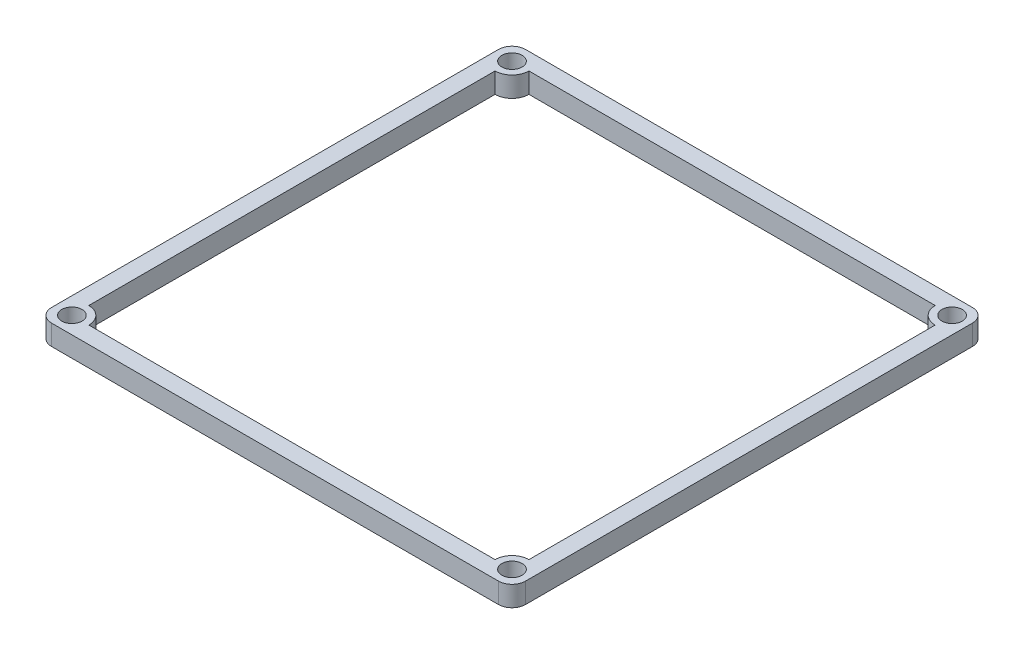
ISO-10303-21;
HEADER;
FILE_DESCRIPTION(('STEP AP214'),'2;1');
FILE_NAME('part.step','',(''),(''),'','','');
FILE_SCHEMA(('AUTOMOTIVE_DESIGN { 1 0 10303 214 1 1 1 1 }'));
ENDSEC;
DATA;
#1=APPLICATION_CONTEXT('core data for automotive mechanical design processes');
#2=APPLICATION_PROTOCOL_DEFINITION('international standard','automotive_design',2000,#1);
#3=PRODUCT_CONTEXT('',#1,'mechanical');
#4=PRODUCT('Part','Part','',(#3));
#5=PRODUCT_RELATED_PRODUCT_CATEGORY('part','',(#4));
#6=PRODUCT_DEFINITION_FORMATION('','',#4);
#7=PRODUCT_DEFINITION_CONTEXT('part definition',#1,'design');
#8=PRODUCT_DEFINITION('design','',#6,#7);
#9=PRODUCT_DEFINITION_SHAPE('','',#8);
#10=(LENGTH_UNIT() NAMED_UNIT(*) SI_UNIT(.MILLI.,.METRE.));
#11=(NAMED_UNIT(*) PLANE_ANGLE_UNIT() SI_UNIT($,.RADIAN.));
#12=(NAMED_UNIT(*) SI_UNIT($,.STERADIAN.) SOLID_ANGLE_UNIT());
#13=UNCERTAINTY_MEASURE_WITH_UNIT(LENGTH_MEASURE(1.E-05),#10,'distance_accuracy_value','');
#14=(GEOMETRIC_REPRESENTATION_CONTEXT(3) GLOBAL_UNCERTAINTY_ASSIGNED_CONTEXT((#13)) GLOBAL_UNIT_ASSIGNED_CONTEXT((#10,
#11,#12)) REPRESENTATION_CONTEXT('',''));
#15=CARTESIAN_POINT('',(0.,0.,0.));
#16=DIRECTION('',(0.,0.,1.));
#17=DIRECTION('',(1.,0.,0.));
#18=AXIS2_PLACEMENT_3D('',#15,#16,#17);
#19=CARTESIAN_POINT('',(0.,3.,0.));
#20=DIRECTION('',(0.,1.,0.));
#21=DIRECTION('',(0.,0.,1.));
#22=AXIS2_PLACEMENT_3D('',#19,#20,#21);
#23=PLANE('',#22);
#24=CARTESIAN_POINT('',(32.5000000000007,3.,32.5));
#25=DIRECTION('',(0.,1.,0.));
#26=DIRECTION('',(0.,0.,1.));
#27=AXIS2_PLACEMENT_3D('',#24,#25,#26);
#28=CIRCLE('',#27,2.5);
#29=CARTESIAN_POINT('',(30.0000000000007,3.,32.5));
#30=VERTEX_POINT('',#29);
#31=CARTESIAN_POINT('',(32.5000000000007,3.,30.));
#32=VERTEX_POINT('',#31);
#33=EDGE_CURVE('E182',#30,#32,#28,.F.);
#34=ORIENTED_EDGE('',*,*,#33,.F.);
#35=DIRECTION('',(-1.,0.,0.));
#36=VECTOR('',#35,1.);
#37=CARTESIAN_POINT('',(0.,3.,32.5));
#38=LINE('',#37,#36);
#39=CARTESIAN_POINT('',(-29.9999999999993,3.,32.5));
#40=VERTEX_POINT('',#39);
#41=EDGE_CURVE('E49',#30,#40,#38,.T.);
#42=ORIENTED_EDGE('',*,*,#41,.T.);
#43=CARTESIAN_POINT('',(-32.4999999999993,3.,32.5));
#44=DIRECTION('',(0.,1.,0.));
#45=DIRECTION('',(0.,0.,1.));
#46=AXIS2_PLACEMENT_3D('',#43,#44,#45);
#47=CIRCLE('',#46,2.5);
#48=CARTESIAN_POINT('',(-32.4999999999993,3.,30.));
#49=VERTEX_POINT('',#48);
#50=EDGE_CURVE('E164',#40,#49,#47,.T.);
#51=ORIENTED_EDGE('',*,*,#50,.T.);
#52=DIRECTION('',(0.,0.,-1.));
#53=VECTOR('',#52,1.);
#54=CARTESIAN_POINT('',(-32.4999999999997,3.,3.68339618065738E-13));
#55=LINE('',#54,#53);
#56=CARTESIAN_POINT('',(-32.5,3.,-30.));
#57=VERTEX_POINT('',#56);
#58=EDGE_CURVE('E167',#49,#57,#55,.T.);
#59=ORIENTED_EDGE('',*,*,#58,.T.);
#60=CARTESIAN_POINT('',(-32.5,3.,-32.5));
#61=DIRECTION('',(0.,1.,0.));
#62=DIRECTION('',(0.,0.,1.));
#63=AXIS2_PLACEMENT_3D('',#60,#61,#62);
#64=CIRCLE('',#63,2.5);
#65=CARTESIAN_POINT('',(-30.,3.,-32.5));
#66=VERTEX_POINT('',#65);
#67=EDGE_CURVE('E193',#57,#66,#64,.T.);
#68=ORIENTED_EDGE('',*,*,#67,.T.);
#69=DIRECTION('',(1.,0.,0.));
#70=VECTOR('',#69,1.);
#71=CARTESIAN_POINT('',(0.,3.,-32.5));
#72=LINE('',#71,#70);
#73=CARTESIAN_POINT('',(30.,3.,-32.5));
#74=VERTEX_POINT('',#73);
#75=EDGE_CURVE('E190',#66,#74,#72,.T.);
#76=ORIENTED_EDGE('',*,*,#75,.T.);
#77=CARTESIAN_POINT('',(32.5,3.,-32.5));
#78=DIRECTION('',(0.,1.,0.));
#79=DIRECTION('',(0.,0.,1.));
#80=AXIS2_PLACEMENT_3D('',#77,#78,#79);
#81=CIRCLE('',#80,2.5);
#82=CARTESIAN_POINT('',(32.5,3.,-30.));
#83=VERTEX_POINT('',#82);
#84=EDGE_CURVE('E187',#83,#74,#81,.F.);
#85=ORIENTED_EDGE('',*,*,#84,.F.);
#86=DIRECTION('',(0.,0.,1.));
#87=VECTOR('',#86,1.);
#88=CARTESIAN_POINT('',(32.5000000000003,3.,-3.68339618065746E-13));
#89=LINE('',#88,#87);
#90=EDGE_CURVE('E184',#83,#32,#89,.T.);
#91=ORIENTED_EDGE('',*,*,#90,.T.);
#92=EDGE_LOOP('',(#34,#42,#51,#59,#68,#76,#85,#91));
#93=FACE_BOUND('',#92,.T.);
#94=CARTESIAN_POINT('',(32.5000000000007,3.,32.5));
#95=DIRECTION('',(0.,1.,0.));
#96=DIRECTION('',(0.,0.,1.));
#97=AXIS2_PLACEMENT_3D('',#94,#95,#96);
#98=CIRCLE('',#97,1.5);
#99=CARTESIAN_POINT('',(32.5000000000007,3.,34.));
#100=VERTEX_POINT('',#99);
#101=EDGE_CURVE('E218',#100,#100,#98,.T.);
#102=ORIENTED_EDGE('',*,*,#101,.F.);
#103=EDGE_LOOP('',(#102));
#104=FACE_BOUND('',#103,.T.);
#105=CARTESIAN_POINT('',(-32.5,3.,-32.5));
#106=DIRECTION('',(0.,1.,0.));
#107=DIRECTION('',(0.,0.,1.));
#108=AXIS2_PLACEMENT_3D('',#105,#106,#107);
#109=CIRCLE('',#108,1.5);
#110=CARTESIAN_POINT('',(-32.5,3.,-31.));
#111=VERTEX_POINT('',#110);
#112=EDGE_CURVE('E230',#111,#111,#109,.T.);
#113=ORIENTED_EDGE('',*,*,#112,.F.);
#114=EDGE_LOOP('',(#113));
#115=FACE_BOUND('',#114,.T.);
#116=DIRECTION('',(-1.,0.,0.));
#117=VECTOR('',#116,1.);
#118=CARTESIAN_POINT('',(-35.,3.,-35.));
#119=LINE('',#118,#117);
#120=CARTESIAN_POINT('',(33.,3.,-35.));
#121=VERTEX_POINT('',#120);
#122=CARTESIAN_POINT('',(-33.,3.,-35.));
#123=VERTEX_POINT('',#122);
#124=EDGE_CURVE('E239',#121,#123,#119,.T.);
#125=ORIENTED_EDGE('',*,*,#124,.T.);
#126=CARTESIAN_POINT('',(-33.,3.,-33.));
#127=DIRECTION('',(0.,1.,0.));
#128=DIRECTION('',(0.,0.,1.));
#129=AXIS2_PLACEMENT_3D('',#126,#127,#128);
#130=CIRCLE('',#129,2.);
#131=CARTESIAN_POINT('',(-35.,3.,-33.));
#132=VERTEX_POINT('',#131);
#133=EDGE_CURVE('E283',#123,#132,#130,.T.);
#134=ORIENTED_EDGE('',*,*,#133,.T.);
#135=DIRECTION('',(0.,0.,1.));
#136=VECTOR('',#135,1.);
#137=CARTESIAN_POINT('',(-35.,3.,-35.));
#138=LINE('',#137,#136);
#139=CARTESIAN_POINT('',(-35.,3.,33.));
#140=VERTEX_POINT('',#139);
#141=EDGE_CURVE('E243',#132,#140,#138,.T.);
#142=ORIENTED_EDGE('',*,*,#141,.T.);
#143=CARTESIAN_POINT('',(-33.,3.,33.));
#144=DIRECTION('',(0.,1.,0.));
#145=DIRECTION('',(0.,0.,1.));
#146=AXIS2_PLACEMENT_3D('',#143,#144,#145);
#147=CIRCLE('',#146,2.);
#148=CARTESIAN_POINT('',(-33.,3.,35.));
#149=VERTEX_POINT('',#148);
#150=EDGE_CURVE('E277',#140,#149,#147,.T.);
#151=ORIENTED_EDGE('',*,*,#150,.T.);
#152=DIRECTION('',(1.,0.,0.));
#153=VECTOR('',#152,1.);
#154=CARTESIAN_POINT('',(-35.,3.,35.));
#155=LINE('',#154,#153);
#156=CARTESIAN_POINT('',(33.,3.,35.));
#157=VERTEX_POINT('',#156);
#158=EDGE_CURVE('E246',#149,#157,#155,.T.);
#159=ORIENTED_EDGE('',*,*,#158,.T.);
#160=CARTESIAN_POINT('',(33.,3.,33.));
#161=DIRECTION('',(0.,1.,0.));
#162=DIRECTION('',(0.,0.,1.));
#163=AXIS2_PLACEMENT_3D('',#160,#161,#162);
#164=CIRCLE('',#163,2.);
#165=CARTESIAN_POINT('',(35.,3.,33.));
#166=VERTEX_POINT('',#165);
#167=EDGE_CURVE('E279',#157,#166,#164,.T.);
#168=ORIENTED_EDGE('',*,*,#167,.T.);
#169=DIRECTION('',(0.,0.,-1.));
#170=VECTOR('',#169,1.);
#171=CARTESIAN_POINT('',(35.,3.,-35.));
#172=LINE('',#171,#170);
#173=CARTESIAN_POINT('',(35.,3.,-33.));
#174=VERTEX_POINT('',#173);
#175=EDGE_CURVE('E236',#166,#174,#172,.T.);
#176=ORIENTED_EDGE('',*,*,#175,.T.);
#177=CARTESIAN_POINT('',(33.,3.,-33.));
#178=DIRECTION('',(0.,1.,0.));
#179=DIRECTION('',(0.,0.,1.));
#180=AXIS2_PLACEMENT_3D('',#177,#178,#179);
#181=CIRCLE('',#180,2.);
#182=EDGE_CURVE('E281',#174,#121,#181,.T.);
#183=ORIENTED_EDGE('',*,*,#182,.T.);
#184=EDGE_LOOP('',(#125,#134,#142,#151,#159,#168,#176,#183));
#185=FACE_BOUND('',#184,.T.);
#186=CARTESIAN_POINT('',(32.5,3.,-32.5));
#187=DIRECTION('',(0.,1.,0.));
#188=DIRECTION('',(0.,0.,1.));
#189=AXIS2_PLACEMENT_3D('',#186,#187,#188);
#190=CIRCLE('',#189,1.5);
#191=CARTESIAN_POINT('',(32.5,3.,-31.));
#192=VERTEX_POINT('',#191);
#193=EDGE_CURVE('E224',#192,#192,#190,.T.);
#194=ORIENTED_EDGE('',*,*,#193,.F.);
#195=EDGE_LOOP('',(#194));
#196=FACE_BOUND('',#195,.T.);
#197=CARTESIAN_POINT('',(-32.4999999999993,3.,32.5));
#198=DIRECTION('',(0.,1.,0.));
#199=DIRECTION('',(0.,0.,1.));
#200=AXIS2_PLACEMENT_3D('',#197,#198,#199);
#201=CIRCLE('',#200,1.5);
#202=CARTESIAN_POINT('',(-32.4999999999993,3.,34.));
#203=VERTEX_POINT('',#202);
#204=EDGE_CURVE('E212',#203,#203,#201,.T.);
#205=ORIENTED_EDGE('',*,*,#204,.F.);
#206=EDGE_LOOP('',(#205));
#207=FACE_BOUND('',#206,.T.);
#208=ADVANCED_FACE('F34',(#93,#104,#115,#185,#196,#207),#23,.T.);
#209=CARTESIAN_POINT('',(0.,0.,0.));
#210=DIRECTION('',(0.,1.,0.));
#211=DIRECTION('',(0.,0.,1.));
#212=AXIS2_PLACEMENT_3D('',#209,#210,#211);
#213=PLANE('',#212);
#214=DIRECTION('',(-1.,0.,0.));
#215=VECTOR('',#214,1.);
#216=CARTESIAN_POINT('',(0.,0.,32.5));
#217=LINE('',#216,#215);
#218=CARTESIAN_POINT('',(30.0000000000007,0.,32.5));
#219=VERTEX_POINT('',#218);
#220=CARTESIAN_POINT('',(-29.9999999999993,0.,32.5));
#221=VERTEX_POINT('',#220);
#222=EDGE_CURVE('E148',#219,#221,#217,.T.);
#223=ORIENTED_EDGE('',*,*,#222,.F.);
#224=CARTESIAN_POINT('',(32.5000000000007,0.,32.5));
#225=DIRECTION('',(0.,1.,0.));
#226=DIRECTION('',(0.,0.,1.));
#227=AXIS2_PLACEMENT_3D('',#224,#225,#226);
#228=CIRCLE('',#227,2.5);
#229=CARTESIAN_POINT('',(32.5000000000007,0.,30.));
#230=VERTEX_POINT('',#229);
#231=EDGE_CURVE('E154',#219,#230,#228,.F.);
#232=ORIENTED_EDGE('',*,*,#231,.T.);
#233=DIRECTION('',(0.,0.,1.));
#234=VECTOR('',#233,1.);
#235=CARTESIAN_POINT('',(32.5000000000003,0.,-3.68339618065746E-13));
#236=LINE('',#235,#234);
#237=CARTESIAN_POINT('',(32.5,0.,-30.));
#238=VERTEX_POINT('',#237);
#239=EDGE_CURVE('E158',#238,#230,#236,.T.);
#240=ORIENTED_EDGE('',*,*,#239,.F.);
#241=CARTESIAN_POINT('',(32.5,0.,-32.5));
#242=DIRECTION('',(0.,1.,0.));
#243=DIRECTION('',(0.,0.,1.));
#244=AXIS2_PLACEMENT_3D('',#241,#242,#243);
#245=CIRCLE('',#244,2.5);
#246=CARTESIAN_POINT('',(30.,0.,-32.5));
#247=VERTEX_POINT('',#246);
#248=EDGE_CURVE('E171',#238,#247,#245,.F.);
#249=ORIENTED_EDGE('',*,*,#248,.T.);
#250=DIRECTION('',(1.,0.,0.));
#251=VECTOR('',#250,1.);
#252=CARTESIAN_POINT('',(0.,0.,-32.5));
#253=LINE('',#252,#251);
#254=CARTESIAN_POINT('',(-30.,0.,-32.5));
#255=VERTEX_POINT('',#254);
#256=EDGE_CURVE('E174',#255,#247,#253,.T.);
#257=ORIENTED_EDGE('',*,*,#256,.F.);
#258=CARTESIAN_POINT('',(-32.5,0.,-32.5));
#259=DIRECTION('',(0.,1.,0.));
#260=DIRECTION('',(0.,0.,1.));
#261=AXIS2_PLACEMENT_3D('',#258,#259,#260);
#262=CIRCLE('',#261,2.5);
#263=CARTESIAN_POINT('',(-32.5,0.,-30.));
#264=VERTEX_POINT('',#263);
#265=EDGE_CURVE('E176',#264,#255,#262,.T.);
#266=ORIENTED_EDGE('',*,*,#265,.F.);
#267=DIRECTION('',(0.,0.,-1.));
#268=VECTOR('',#267,1.);
#269=CARTESIAN_POINT('',(-32.4999999999997,0.,3.68339618065738E-13));
#270=LINE('',#269,#268);
#271=CARTESIAN_POINT('',(-32.4999999999993,0.,30.));
#272=VERTEX_POINT('',#271);
#273=EDGE_CURVE('E178',#272,#264,#270,.T.);
#274=ORIENTED_EDGE('',*,*,#273,.F.);
#275=CARTESIAN_POINT('',(-32.4999999999993,0.,32.5));
#276=DIRECTION('',(0.,1.,0.));
#277=DIRECTION('',(0.,0.,1.));
#278=AXIS2_PLACEMENT_3D('',#275,#276,#277);
#279=CIRCLE('',#278,2.5);
#280=EDGE_CURVE('E151',#221,#272,#279,.T.);
#281=ORIENTED_EDGE('',*,*,#280,.F.);
#282=EDGE_LOOP('',(#223,#232,#240,#249,#257,#266,#274,#281));
#283=FACE_BOUND('',#282,.T.);
#284=DIRECTION('',(0.,0.,1.));
#285=VECTOR('',#284,1.);
#286=CARTESIAN_POINT('',(-35.,0.,-35.));
#287=LINE('',#286,#285);
#288=CARTESIAN_POINT('',(-35.,0.,-33.));
#289=VERTEX_POINT('',#288);
#290=CARTESIAN_POINT('',(-35.,0.,33.));
#291=VERTEX_POINT('',#290);
#292=EDGE_CURVE('E255',#289,#291,#287,.T.);
#293=ORIENTED_EDGE('',*,*,#292,.F.);
#294=CARTESIAN_POINT('',(-33.,0.,-33.));
#295=DIRECTION('',(0.,1.,0.));
#296=DIRECTION('',(0.,0.,1.));
#297=AXIS2_PLACEMENT_3D('',#294,#295,#296);
#298=CIRCLE('',#297,2.);
#299=CARTESIAN_POINT('',(-33.,0.,-35.));
#300=VERTEX_POINT('',#299);
#301=EDGE_CURVE('E270',#289,#300,#298,.F.);
#302=ORIENTED_EDGE('',*,*,#301,.T.);
#303=DIRECTION('',(-1.,0.,0.));
#304=VECTOR('',#303,1.);
#305=CARTESIAN_POINT('',(-35.,0.,-35.));
#306=LINE('',#305,#304);
#307=CARTESIAN_POINT('',(33.,0.,-35.));
#308=VERTEX_POINT('',#307);
#309=EDGE_CURVE('E252',#308,#300,#306,.T.);
#310=ORIENTED_EDGE('',*,*,#309,.F.);
#311=CARTESIAN_POINT('',(33.,0.,-33.));
#312=DIRECTION('',(0.,1.,0.));
#313=DIRECTION('',(0.,0.,1.));
#314=AXIS2_PLACEMENT_3D('',#311,#312,#313);
#315=CIRCLE('',#314,2.);
#316=CARTESIAN_POINT('',(35.,0.,-33.));
#317=VERTEX_POINT('',#316);
#318=EDGE_CURVE('E268',#308,#317,#315,.F.);
#319=ORIENTED_EDGE('',*,*,#318,.T.);
#320=DIRECTION('',(0.,0.,-1.));
#321=VECTOR('',#320,1.);
#322=CARTESIAN_POINT('',(35.,0.,-35.));
#323=LINE('',#322,#321);
#324=CARTESIAN_POINT('',(35.,0.,33.));
#325=VERTEX_POINT('',#324);
#326=EDGE_CURVE('E233',#325,#317,#323,.T.);
#327=ORIENTED_EDGE('',*,*,#326,.F.);
#328=CARTESIAN_POINT('',(33.,0.,33.));
#329=DIRECTION('',(0.,1.,0.));
#330=DIRECTION('',(0.,0.,1.));
#331=AXIS2_PLACEMENT_3D('',#328,#329,#330);
#332=CIRCLE('',#331,2.);
#333=CARTESIAN_POINT('',(33.,0.,35.));
#334=VERTEX_POINT('',#333);
#335=EDGE_CURVE('E266',#325,#334,#332,.F.);
#336=ORIENTED_EDGE('',*,*,#335,.T.);
#337=DIRECTION('',(1.,0.,0.));
#338=VECTOR('',#337,1.);
#339=CARTESIAN_POINT('',(-35.,0.,35.));
#340=LINE('',#339,#338);
#341=CARTESIAN_POINT('',(-33.,0.,35.));
#342=VERTEX_POINT('',#341);
#343=EDGE_CURVE('E240',#342,#334,#340,.T.);
#344=ORIENTED_EDGE('',*,*,#343,.F.);
#345=CARTESIAN_POINT('',(-33.,0.,33.));
#346=DIRECTION('',(0.,1.,0.));
#347=DIRECTION('',(0.,0.,1.));
#348=AXIS2_PLACEMENT_3D('',#345,#346,#347);
#349=CIRCLE('',#348,2.);
#350=EDGE_CURVE('E264',#342,#291,#349,.F.);
#351=ORIENTED_EDGE('',*,*,#350,.T.);
#352=EDGE_LOOP('',(#293,#302,#310,#319,#327,#336,#344,#351));
#353=FACE_BOUND('',#352,.T.);
#354=CARTESIAN_POINT('',(-32.5,0.,-32.5));
#355=DIRECTION('',(0.,1.,0.));
#356=DIRECTION('',(0.,0.,1.));
#357=AXIS2_PLACEMENT_3D('',#354,#355,#356);
#358=CIRCLE('',#357,1.5);
#359=CARTESIAN_POINT('',(-32.5,0.,-31.));
#360=VERTEX_POINT('',#359);
#361=EDGE_CURVE('E227',#360,#360,#358,.T.);
#362=ORIENTED_EDGE('',*,*,#361,.T.);
#363=EDGE_LOOP('',(#362));
#364=FACE_BOUND('',#363,.T.);
#365=CARTESIAN_POINT('',(32.5,0.,-32.5));
#366=DIRECTION('',(0.,1.,0.));
#367=DIRECTION('',(0.,0.,1.));
#368=AXIS2_PLACEMENT_3D('',#365,#366,#367);
#369=CIRCLE('',#368,1.5);
#370=CARTESIAN_POINT('',(32.5,0.,-31.));
#371=VERTEX_POINT('',#370);
#372=EDGE_CURVE('E221',#371,#371,#369,.T.);
#373=ORIENTED_EDGE('',*,*,#372,.T.);
#374=EDGE_LOOP('',(#373));
#375=FACE_BOUND('',#374,.T.);
#376=CARTESIAN_POINT('',(32.5000000000007,0.,32.5));
#377=DIRECTION('',(0.,1.,0.));
#378=DIRECTION('',(0.,0.,1.));
#379=AXIS2_PLACEMENT_3D('',#376,#377,#378);
#380=CIRCLE('',#379,1.5);
#381=CARTESIAN_POINT('',(32.5000000000007,0.,34.));
#382=VERTEX_POINT('',#381);
#383=EDGE_CURVE('E215',#382,#382,#380,.T.);
#384=ORIENTED_EDGE('',*,*,#383,.T.);
#385=EDGE_LOOP('',(#384));
#386=FACE_BOUND('',#385,.T.);
#387=CARTESIAN_POINT('',(-32.4999999999993,0.,32.5));
#388=DIRECTION('',(0.,1.,0.));
#389=DIRECTION('',(0.,0.,1.));
#390=AXIS2_PLACEMENT_3D('',#387,#388,#389);
#391=CIRCLE('',#390,1.5);
#392=CARTESIAN_POINT('',(-32.4999999999993,0.,34.));
#393=VERTEX_POINT('',#392);
#394=EDGE_CURVE('E200',#393,#393,#391,.T.);
#395=ORIENTED_EDGE('',*,*,#394,.T.);
#396=EDGE_LOOP('',(#395));
#397=FACE_BOUND('',#396,.T.);
#398=ADVANCED_FACE('F161',(#283,#353,#364,#375,#386,#397),#213,.F.);
#399=CARTESIAN_POINT('',(35.,3.,-35.));
#400=DIRECTION('',(-1.,0.,0.));
#401=DIRECTION('',(0.,0.,1.));
#402=AXIS2_PLACEMENT_3D('',#399,#400,#401);
#403=PLANE('',#402);
#404=ORIENTED_EDGE('',*,*,#326,.T.);
#405=DIRECTION('',(0.,-1.,0.));
#406=VECTOR('',#405,1.);
#407=CARTESIAN_POINT('',(35.,3.,-33.));
#408=LINE('',#407,#406);
#409=EDGE_CURVE('E288',#317,#174,#408,.F.);
#410=ORIENTED_EDGE('',*,*,#409,.T.);
#411=ORIENTED_EDGE('',*,*,#175,.F.);
#412=DIRECTION('',(0.,-1.,0.));
#413=VECTOR('',#412,1.);
#414=CARTESIAN_POINT('',(35.,3.,33.));
#415=LINE('',#414,#413);
#416=EDGE_CURVE('E285',#166,#325,#415,.T.);
#417=ORIENTED_EDGE('',*,*,#416,.T.);
#418=EDGE_LOOP('',(#404,#410,#411,#417));
#419=FACE_BOUND('',#418,.T.);
#420=ADVANCED_FACE('F307',(#419),#403,.F.);
#421=CARTESIAN_POINT('',(-35.,3.,-35.));
#422=DIRECTION('',(0.,0.,1.));
#423=DIRECTION('',(1.,0.,0.));
#424=AXIS2_PLACEMENT_3D('',#421,#422,#423);
#425=PLANE('',#424);
#426=ORIENTED_EDGE('',*,*,#309,.T.);
#427=DIRECTION('',(0.,-1.,0.));
#428=VECTOR('',#427,1.);
#429=CARTESIAN_POINT('',(-33.,3.,-35.));
#430=LINE('',#429,#428);
#431=EDGE_CURVE('E275',#300,#123,#430,.F.);
#432=ORIENTED_EDGE('',*,*,#431,.T.);
#433=ORIENTED_EDGE('',*,*,#124,.F.);
#434=DIRECTION('',(0.,-1.,0.));
#435=VECTOR('',#434,1.);
#436=CARTESIAN_POINT('',(33.,3.,-35.));
#437=LINE('',#436,#435);
#438=EDGE_CURVE('E272',#121,#308,#437,.T.);
#439=ORIENTED_EDGE('',*,*,#438,.T.);
#440=EDGE_LOOP('',(#426,#432,#433,#439));
#441=FACE_BOUND('',#440,.T.);
#442=ADVANCED_FACE('F318',(#441),#425,.F.);
#443=CARTESIAN_POINT('',(-35.,3.,-35.));
#444=DIRECTION('',(1.,0.,0.));
#445=DIRECTION('',(0.,0.,-1.));
#446=AXIS2_PLACEMENT_3D('',#443,#444,#445);
#447=PLANE('',#446);
#448=ORIENTED_EDGE('',*,*,#141,.F.);
#449=DIRECTION('',(0.,-1.,0.));
#450=VECTOR('',#449,1.);
#451=CARTESIAN_POINT('',(-35.,3.,-33.));
#452=LINE('',#451,#450);
#453=EDGE_CURVE('E261',#132,#289,#452,.T.);
#454=ORIENTED_EDGE('',*,*,#453,.T.);
#455=ORIENTED_EDGE('',*,*,#292,.T.);
#456=DIRECTION('',(0.,-1.,0.));
#457=VECTOR('',#456,1.);
#458=CARTESIAN_POINT('',(-35.,3.,33.));
#459=LINE('',#458,#457);
#460=EDGE_CURVE('E249',#291,#140,#459,.F.);
#461=ORIENTED_EDGE('',*,*,#460,.T.);
#462=EDGE_LOOP('',(#448,#454,#455,#461));
#463=FACE_BOUND('',#462,.T.);
#464=ADVANCED_FACE('F326',(#463),#447,.F.);
#465=CARTESIAN_POINT('',(-35.,3.,35.));
#466=DIRECTION('',(0.,0.,-1.));
#467=DIRECTION('',(-1.,0.,0.));
#468=AXIS2_PLACEMENT_3D('',#465,#466,#467);
#469=PLANE('',#468);
#470=ORIENTED_EDGE('',*,*,#343,.T.);
#471=DIRECTION('',(0.,-1.,0.));
#472=VECTOR('',#471,1.);
#473=CARTESIAN_POINT('',(33.,3.,35.));
#474=LINE('',#473,#472);
#475=EDGE_CURVE('E11',#334,#157,#474,.F.);
#476=ORIENTED_EDGE('',*,*,#475,.T.);
#477=ORIENTED_EDGE('',*,*,#158,.F.);
#478=DIRECTION('',(0.,-1.,0.));
#479=VECTOR('',#478,1.);
#480=CARTESIAN_POINT('',(-33.,3.,35.));
#481=LINE('',#480,#479);
#482=EDGE_CURVE('E42',#149,#342,#481,.T.);
#483=ORIENTED_EDGE('',*,*,#482,.T.);
#484=EDGE_LOOP('',(#470,#476,#477,#483));
#485=FACE_BOUND('',#484,.T.);
#486=ADVANCED_FACE('F294',(#485),#469,.F.);
#487=CARTESIAN_POINT('',(-32.5,3.,-32.5));
#488=DIRECTION('',(0.,-1.,0.));
#489=DIRECTION('',(0.,0.,-1.));
#490=AXIS2_PLACEMENT_3D('',#487,#488,#489);
#491=CYLINDRICAL_SURFACE('',#490,1.5);
#492=ORIENTED_EDGE('',*,*,#112,.T.);
#493=EDGE_LOOP('',(#492));
#494=FACE_BOUND('',#493,.T.);
#495=ORIENTED_EDGE('',*,*,#361,.F.);
#496=EDGE_LOOP('',(#495));
#497=FACE_BOUND('',#496,.T.);
#498=ADVANCED_FACE('F344',(#494,#497),#491,.F.);
#499=CARTESIAN_POINT('',(32.5,3.,-32.5));
#500=DIRECTION('',(0.,-1.,0.));
#501=DIRECTION('',(0.,0.,-1.));
#502=AXIS2_PLACEMENT_3D('',#499,#500,#501);
#503=CYLINDRICAL_SURFACE('',#502,1.5);
#504=ORIENTED_EDGE('',*,*,#193,.T.);
#505=EDGE_LOOP('',(#504));
#506=FACE_BOUND('',#505,.T.);
#507=ORIENTED_EDGE('',*,*,#372,.F.);
#508=EDGE_LOOP('',(#507));
#509=FACE_BOUND('',#508,.T.);
#510=ADVANCED_FACE('F454',(#506,#509),#503,.F.);
#511=CARTESIAN_POINT('',(32.5000000000007,3.,32.5));
#512=DIRECTION('',(0.,-1.,0.));
#513=DIRECTION('',(0.,0.,-1.));
#514=AXIS2_PLACEMENT_3D('',#511,#512,#513);
#515=CYLINDRICAL_SURFACE('',#514,1.5);
#516=ORIENTED_EDGE('',*,*,#101,.T.);
#517=EDGE_LOOP('',(#516));
#518=FACE_BOUND('',#517,.T.);
#519=ORIENTED_EDGE('',*,*,#383,.F.);
#520=EDGE_LOOP('',(#519));
#521=FACE_BOUND('',#520,.T.);
#522=ADVANCED_FACE('F451',(#518,#521),#515,.F.);
#523=CARTESIAN_POINT('',(-32.4999999999993,3.,32.5));
#524=DIRECTION('',(0.,-1.,0.));
#525=DIRECTION('',(0.,0.,-1.));
#526=AXIS2_PLACEMENT_3D('',#523,#524,#525);
#527=CYLINDRICAL_SURFACE('',#526,1.5);
#528=ORIENTED_EDGE('',*,*,#204,.T.);
#529=EDGE_LOOP('',(#528));
#530=FACE_BOUND('',#529,.T.);
#531=ORIENTED_EDGE('',*,*,#394,.F.);
#532=EDGE_LOOP('',(#531));
#533=FACE_BOUND('',#532,.T.);
#534=ADVANCED_FACE('F357',(#530,#533),#527,.F.);
#535=CARTESIAN_POINT('',(-33.,3.,-33.));
#536=DIRECTION('',(0.,-1.,0.));
#537=DIRECTION('',(0.,0.,-1.));
#538=AXIS2_PLACEMENT_3D('',#535,#536,#537);
#539=CYLINDRICAL_SURFACE('',#538,2.);
#540=ORIENTED_EDGE('',*,*,#133,.F.);
#541=ORIENTED_EDGE('',*,*,#431,.F.);
#542=ORIENTED_EDGE('',*,*,#301,.F.);
#543=ORIENTED_EDGE('',*,*,#453,.F.);
#544=EDGE_LOOP('',(#540,#541,#542,#543));
#545=FACE_BOUND('',#544,.T.);
#546=ADVANCED_FACE('F323',(#545),#539,.T.);
#547=CARTESIAN_POINT('',(33.,3.,-33.));
#548=DIRECTION('',(0.,-1.,0.));
#549=DIRECTION('',(0.,0.,-1.));
#550=AXIS2_PLACEMENT_3D('',#547,#548,#549);
#551=CYLINDRICAL_SURFACE('',#550,2.);
#552=ORIENTED_EDGE('',*,*,#182,.F.);
#553=ORIENTED_EDGE('',*,*,#409,.F.);
#554=ORIENTED_EDGE('',*,*,#318,.F.);
#555=ORIENTED_EDGE('',*,*,#438,.F.);
#556=EDGE_LOOP('',(#552,#553,#554,#555));
#557=FACE_BOUND('',#556,.T.);
#558=ADVANCED_FACE('F315',(#557),#551,.T.);
#559=CARTESIAN_POINT('',(33.,3.,33.));
#560=DIRECTION('',(0.,-1.,0.));
#561=DIRECTION('',(0.,0.,-1.));
#562=AXIS2_PLACEMENT_3D('',#559,#560,#561);
#563=CYLINDRICAL_SURFACE('',#562,2.);
#564=ORIENTED_EDGE('',*,*,#167,.F.);
#565=ORIENTED_EDGE('',*,*,#475,.F.);
#566=ORIENTED_EDGE('',*,*,#335,.F.);
#567=ORIENTED_EDGE('',*,*,#416,.F.);
#568=EDGE_LOOP('',(#564,#565,#566,#567));
#569=FACE_BOUND('',#568,.T.);
#570=ADVANCED_FACE('F304',(#569),#563,.T.);
#571=CARTESIAN_POINT('',(-33.,3.,33.));
#572=DIRECTION('',(0.,-1.,0.));
#573=DIRECTION('',(0.,0.,-1.));
#574=AXIS2_PLACEMENT_3D('',#571,#572,#573);
#575=CYLINDRICAL_SURFACE('',#574,2.);
#576=ORIENTED_EDGE('',*,*,#150,.F.);
#577=ORIENTED_EDGE('',*,*,#460,.F.);
#578=ORIENTED_EDGE('',*,*,#350,.F.);
#579=ORIENTED_EDGE('',*,*,#482,.F.);
#580=EDGE_LOOP('',(#576,#577,#578,#579));
#581=FACE_BOUND('',#580,.T.);
#582=ADVANCED_FACE('F36',(#581),#575,.T.);
#583=CARTESIAN_POINT('',(0.,0.,32.5));
#584=DIRECTION('',(0.,0.,-1.));
#585=DIRECTION('',(-1.,0.,0.));
#586=AXIS2_PLACEMENT_3D('',#583,#584,#585);
#587=PLANE('',#586);
#588=ORIENTED_EDGE('',*,*,#41,.F.);
#589=DIRECTION('',(0.,1.,0.));
#590=VECTOR('',#589,1.);
#591=CARTESIAN_POINT('',(30.0000000000007,0.,32.5));
#592=LINE('',#591,#590);
#593=EDGE_CURVE('E145',#219,#30,#592,.T.);
#594=ORIENTED_EDGE('',*,*,#593,.F.);
#595=ORIENTED_EDGE('',*,*,#222,.T.);
#596=DIRECTION('',(0.,1.,0.));
#597=VECTOR('',#596,1.);
#598=CARTESIAN_POINT('',(-29.9999999999993,0.,32.5));
#599=LINE('',#598,#597);
#600=EDGE_CURVE('E198',#221,#40,#599,.T.);
#601=ORIENTED_EDGE('',*,*,#600,.T.);
#602=EDGE_LOOP('',(#588,#594,#595,#601));
#603=FACE_BOUND('',#602,.T.);
#604=ADVANCED_FACE('F146',(#603),#587,.T.);
#605=CARTESIAN_POINT('',(-32.4999999999993,0.,32.5));
#606=DIRECTION('',(0.,1.,0.));
#607=DIRECTION('',(0.,0.,1.));
#608=AXIS2_PLACEMENT_3D('',#605,#606,#607);
#609=CYLINDRICAL_SURFACE('',#608,2.5);
#610=ORIENTED_EDGE('',*,*,#50,.F.);
#611=ORIENTED_EDGE('',*,*,#600,.F.);
#612=ORIENTED_EDGE('',*,*,#280,.T.);
#613=DIRECTION('',(0.,1.,0.));
#614=VECTOR('',#613,1.);
#615=CARTESIAN_POINT('',(-32.4999999999993,0.,30.));
#616=LINE('',#615,#614);
#617=EDGE_CURVE('E201',#272,#49,#616,.T.);
#618=ORIENTED_EDGE('',*,*,#617,.T.);
#619=EDGE_LOOP('',(#610,#611,#612,#618));
#620=FACE_BOUND('',#619,.T.);
#621=ADVANCED_FACE('F333',(#620),#609,.T.);
#622=CARTESIAN_POINT('',(-32.4999999999997,0.,3.68339618065738E-13));
#623=DIRECTION('',(1.,0.,0.));
#624=DIRECTION('',(0.,0.,-1.));
#625=AXIS2_PLACEMENT_3D('',#622,#623,#624);
#626=PLANE('',#625);
#627=ORIENTED_EDGE('',*,*,#58,.F.);
#628=ORIENTED_EDGE('',*,*,#617,.F.);
#629=ORIENTED_EDGE('',*,*,#273,.T.);
#630=DIRECTION('',(0.,1.,0.));
#631=VECTOR('',#630,1.);
#632=CARTESIAN_POINT('',(-32.5,0.,-30.));
#633=LINE('',#632,#631);
#634=EDGE_CURVE('E203',#264,#57,#633,.T.);
#635=ORIENTED_EDGE('',*,*,#634,.T.);
#636=EDGE_LOOP('',(#627,#628,#629,#635));
#637=FACE_BOUND('',#636,.T.);
#638=ADVANCED_FACE('F387',(#637),#626,.T.);
#639=CARTESIAN_POINT('',(-32.5,0.,-32.5));
#640=DIRECTION('',(0.,1.,0.));
#641=DIRECTION('',(0.,0.,1.));
#642=AXIS2_PLACEMENT_3D('',#639,#640,#641);
#643=CYLINDRICAL_SURFACE('',#642,2.5);
#644=ORIENTED_EDGE('',*,*,#67,.F.);
#645=ORIENTED_EDGE('',*,*,#634,.F.);
#646=ORIENTED_EDGE('',*,*,#265,.T.);
#647=DIRECTION('',(0.,1.,0.));
#648=VECTOR('',#647,1.);
#649=CARTESIAN_POINT('',(-30.,0.,-32.5));
#650=LINE('',#649,#648);
#651=EDGE_CURVE('E205',#255,#66,#650,.T.);
#652=ORIENTED_EDGE('',*,*,#651,.T.);
#653=EDGE_LOOP('',(#644,#645,#646,#652));
#654=FACE_BOUND('',#653,.T.);
#655=ADVANCED_FACE('F396',(#654),#643,.T.);
#656=CARTESIAN_POINT('',(0.,0.,-32.5));
#657=DIRECTION('',(0.,0.,1.));
#658=DIRECTION('',(1.,0.,0.));
#659=AXIS2_PLACEMENT_3D('',#656,#657,#658);
#660=PLANE('',#659);
#661=ORIENTED_EDGE('',*,*,#75,.F.);
#662=ORIENTED_EDGE('',*,*,#651,.F.);
#663=ORIENTED_EDGE('',*,*,#256,.T.);
#664=DIRECTION('',(0.,1.,0.));
#665=VECTOR('',#664,1.);
#666=CARTESIAN_POINT('',(30.,0.,-32.5));
#667=LINE('',#666,#665);
#668=EDGE_CURVE('E207',#247,#74,#667,.T.);
#669=ORIENTED_EDGE('',*,*,#668,.T.);
#670=EDGE_LOOP('',(#661,#662,#663,#669));
#671=FACE_BOUND('',#670,.T.);
#672=ADVANCED_FACE('F405',(#671),#660,.T.);
#673=CARTESIAN_POINT('',(32.5,0.,-32.5));
#674=DIRECTION('',(0.,1.,0.));
#675=DIRECTION('',(0.,0.,1.));
#676=AXIS2_PLACEMENT_3D('',#673,#674,#675);
#677=CYLINDRICAL_SURFACE('',#676,2.5);
#678=ORIENTED_EDGE('',*,*,#84,.T.);
#679=ORIENTED_EDGE('',*,*,#668,.F.);
#680=ORIENTED_EDGE('',*,*,#248,.F.);
#681=DIRECTION('',(0.,1.,0.));
#682=VECTOR('',#681,1.);
#683=CARTESIAN_POINT('',(32.5,0.,-30.));
#684=LINE('',#683,#682);
#685=EDGE_CURVE('E209',#238,#83,#684,.T.);
#686=ORIENTED_EDGE('',*,*,#685,.T.);
#687=EDGE_LOOP('',(#678,#679,#680,#686));
#688=FACE_BOUND('',#687,.T.);
#689=ADVANCED_FACE('F414',(#688),#677,.T.);
#690=CARTESIAN_POINT('',(32.5000000000003,0.,-3.68339618065746E-13));
#691=DIRECTION('',(-1.,0.,0.));
#692=DIRECTION('',(0.,0.,1.));
#693=AXIS2_PLACEMENT_3D('',#690,#691,#692);
#694=PLANE('',#693);
#695=ORIENTED_EDGE('',*,*,#90,.F.);
#696=ORIENTED_EDGE('',*,*,#685,.F.);
#697=ORIENTED_EDGE('',*,*,#239,.T.);
#698=DIRECTION('',(0.,1.,0.));
#699=VECTOR('',#698,1.);
#700=CARTESIAN_POINT('',(32.5000000000007,0.,30.));
#701=LINE('',#700,#699);
#702=EDGE_CURVE('E57',#230,#32,#701,.T.);
#703=ORIENTED_EDGE('',*,*,#702,.T.);
#704=EDGE_LOOP('',(#695,#696,#697,#703));
#705=FACE_BOUND('',#704,.T.);
#706=ADVANCED_FACE('F423',(#705),#694,.T.);
#707=CARTESIAN_POINT('',(32.5000000000007,0.,32.5));
#708=DIRECTION('',(0.,1.,0.));
#709=DIRECTION('',(0.,0.,1.));
#710=AXIS2_PLACEMENT_3D('',#707,#708,#709);
#711=CYLINDRICAL_SURFACE('',#710,2.5);
#712=ORIENTED_EDGE('',*,*,#33,.T.);
#713=ORIENTED_EDGE('',*,*,#702,.F.);
#714=ORIENTED_EDGE('',*,*,#231,.F.);
#715=ORIENTED_EDGE('',*,*,#593,.T.);
#716=EDGE_LOOP('',(#712,#713,#714,#715));
#717=FACE_BOUND('',#716,.T.);
#718=ADVANCED_FACE('F155',(#717),#711,.T.);
#719=CLOSED_SHELL('',(#208,#398,#420,#442,#464,#486,#498,#510,#522,#534,#546,#558,#570,#582,
#604,#621,#638,#655,#672,#689,#706,#718));
#720=MANIFOLD_SOLID_BREP('B2',#719);
#721=ADVANCED_BREP_SHAPE_REPRESENTATION('',(#18,#720),#14);
#722=SHAPE_DEFINITION_REPRESENTATION(#9,#721);
ENDSEC;
END-ISO-10303-21;
